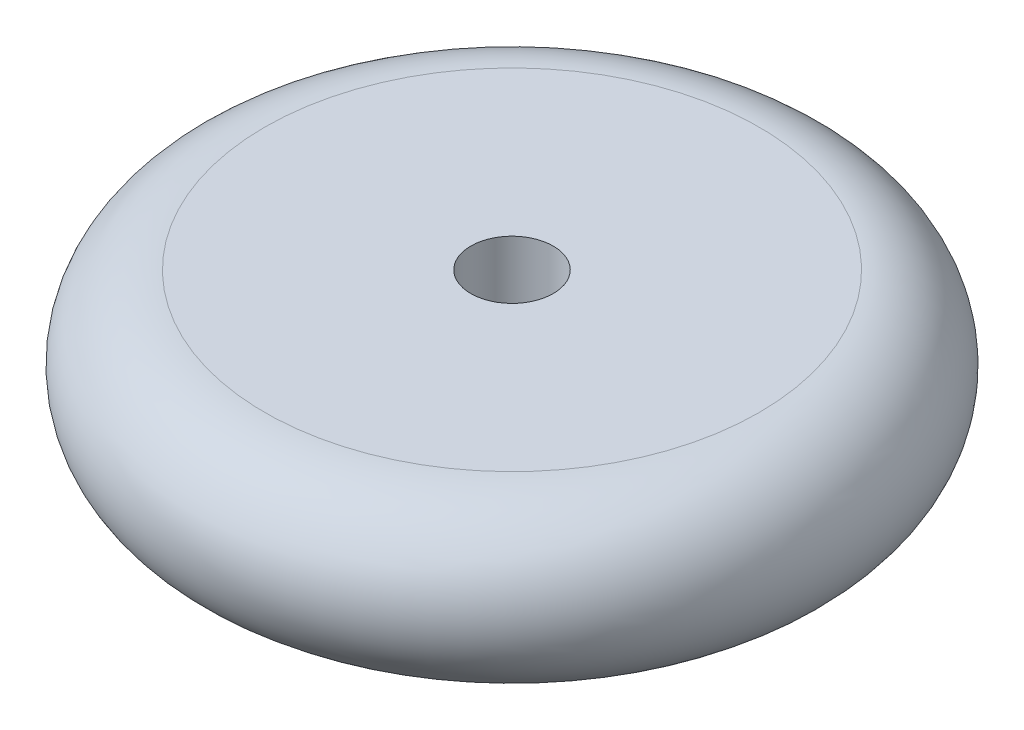
ISO-10303-21;
HEADER;
FILE_DESCRIPTION(('STEP AP214'),'2;1');
FILE_NAME('part.step','',(''),(''),'','','');
FILE_SCHEMA(('AUTOMOTIVE_DESIGN { 1 0 10303 214 1 1 1 1 }'));
ENDSEC;
DATA;
#1=APPLICATION_CONTEXT('core data for automotive mechanical design processes');
#2=APPLICATION_PROTOCOL_DEFINITION('international standard','automotive_design',2000,#1);
#3=PRODUCT_CONTEXT('',#1,'mechanical');
#4=PRODUCT('Part','Part','',(#3));
#5=PRODUCT_RELATED_PRODUCT_CATEGORY('part','',(#4));
#6=PRODUCT_DEFINITION_FORMATION('','',#4);
#7=PRODUCT_DEFINITION_CONTEXT('part definition',#1,'design');
#8=PRODUCT_DEFINITION('design','',#6,#7);
#9=PRODUCT_DEFINITION_SHAPE('','',#8);
#10=(LENGTH_UNIT() NAMED_UNIT(*) SI_UNIT(.MILLI.,.METRE.));
#11=(NAMED_UNIT(*) PLANE_ANGLE_UNIT() SI_UNIT($,.RADIAN.));
#12=(NAMED_UNIT(*) SI_UNIT($,.STERADIAN.) SOLID_ANGLE_UNIT());
#13=UNCERTAINTY_MEASURE_WITH_UNIT(LENGTH_MEASURE(1.E-05),#10,'distance_accuracy_value','');
#14=(GEOMETRIC_REPRESENTATION_CONTEXT(3) GLOBAL_UNCERTAINTY_ASSIGNED_CONTEXT((#13)) GLOBAL_UNIT_ASSIGNED_CONTEXT((#10,
#11,#12)) REPRESENTATION_CONTEXT('',''));
#15=CARTESIAN_POINT('',(0.,0.,0.));
#16=DIRECTION('',(0.,0.,1.));
#17=DIRECTION('',(1.,0.,0.));
#18=AXIS2_PLACEMENT_3D('',#15,#16,#17);
#19=CARTESIAN_POINT('',(0.,-5.,0.));
#20=DIRECTION('',(0.,-1.,0.));
#21=DIRECTION('',(1.,0.,0.));
#22=AXIS2_PLACEMENT_3D('',#19,#20,#21);
#23=TOROIDAL_SURFACE('',#22,15.,5.);
#24=CARTESIAN_POINT('',(0.,-10.,0.));
#25=DIRECTION('',(0.,-1.,0.));
#26=DIRECTION('',(1.,0.,0.));
#27=AXIS2_PLACEMENT_3D('',#24,#25,#26);
#28=CIRCLE('',#27,15.);
#29=CARTESIAN_POINT('',(15.,-10.,0.));
#30=VERTEX_POINT('',#29);
#31=EDGE_CURVE('E9',#30,#30,#28,.T.);
#32=ORIENTED_EDGE('',*,*,#31,.F.);
#33=EDGE_LOOP('',(#32));
#34=FACE_BOUND('',#33,.T.);
#35=CARTESIAN_POINT('',(0.,0.,0.));
#36=DIRECTION('',(0.,-1.,0.));
#37=DIRECTION('',(1.,0.,0.));
#38=AXIS2_PLACEMENT_3D('',#35,#36,#37);
#39=CIRCLE('',#38,15.);
#40=CARTESIAN_POINT('',(15.,0.,0.));
#41=VERTEX_POINT('',#40);
#42=EDGE_CURVE('E21',#41,#41,#39,.F.);
#43=ORIENTED_EDGE('',*,*,#42,.F.);
#44=EDGE_LOOP('',(#43));
#45=FACE_BOUND('',#44,.T.);
#46=ADVANCED_FACE('F14',(#34,#45),#23,.T.);
#47=CARTESIAN_POINT('',(0.,-10.,0.));
#48=DIRECTION('',(0.,-1.,0.));
#49=DIRECTION('',(1.,0.,0.));
#50=AXIS2_PLACEMENT_3D('',#47,#48,#49);
#51=PLANE('',#50);
#52=CARTESIAN_POINT('',(0.,-10.,0.));
#53=DIRECTION('',(0.,1.,0.));
#54=DIRECTION('',(-1.,0.,0.));
#55=AXIS2_PLACEMENT_3D('',#52,#53,#54);
#56=CIRCLE('',#55,2.5);
#57=CARTESIAN_POINT('',(-2.5,-10.,0.));
#58=VERTEX_POINT('',#57);
#59=EDGE_CURVE('E28',#58,#58,#56,.T.);
#60=ORIENTED_EDGE('',*,*,#59,.T.);
#61=EDGE_LOOP('',(#60));
#62=FACE_BOUND('',#61,.T.);
#63=ORIENTED_EDGE('',*,*,#31,.T.);
#64=EDGE_LOOP('',(#63));
#65=FACE_BOUND('',#64,.T.);
#66=ADVANCED_FACE('F47',(#62,#65),#51,.T.);
#67=CARTESIAN_POINT('',(0.,0.,0.));
#68=DIRECTION('',(0.,-1.,0.));
#69=DIRECTION('',(1.,0.,0.));
#70=AXIS2_PLACEMENT_3D('',#67,#68,#69);
#71=PLANE('',#70);
#72=CARTESIAN_POINT('',(0.,0.,0.));
#73=DIRECTION('',(0.,1.,0.));
#74=DIRECTION('',(-1.,0.,0.));
#75=AXIS2_PLACEMENT_3D('',#72,#73,#74);
#76=CIRCLE('',#75,2.5);
#77=CARTESIAN_POINT('',(-2.5,0.,0.));
#78=VERTEX_POINT('',#77);
#79=EDGE_CURVE('E34',#78,#78,#76,.T.);
#80=ORIENTED_EDGE('',*,*,#79,.F.);
#81=EDGE_LOOP('',(#80));
#82=FACE_BOUND('',#81,.T.);
#83=ORIENTED_EDGE('',*,*,#42,.T.);
#84=EDGE_LOOP('',(#83));
#85=FACE_BOUND('',#84,.T.);
#86=ADVANCED_FACE('F45',(#82,#85),#71,.F.);
#87=CARTESIAN_POINT('',(0.,-10.,0.));
#88=DIRECTION('',(0.,1.,0.));
#89=DIRECTION('',(-1.,0.,0.));
#90=AXIS2_PLACEMENT_3D('',#87,#88,#89);
#91=CYLINDRICAL_SURFACE('',#90,2.5);
#92=ORIENTED_EDGE('',*,*,#59,.F.);
#93=EDGE_LOOP('',(#92));
#94=FACE_BOUND('',#93,.T.);
#95=ORIENTED_EDGE('',*,*,#79,.T.);
#96=EDGE_LOOP('',(#95));
#97=FACE_BOUND('',#96,.T.);
#98=ADVANCED_FACE('F43',(#94,#97),#91,.F.);
#99=CLOSED_SHELL('',(#46,#66,#86,#98));
#100=MANIFOLD_SOLID_BREP('B1',#99);
#101=ADVANCED_BREP_SHAPE_REPRESENTATION('',(#18,#100),#14);
#102=SHAPE_DEFINITION_REPRESENTATION(#9,#101);
ENDSEC;
END-ISO-10303-21;
